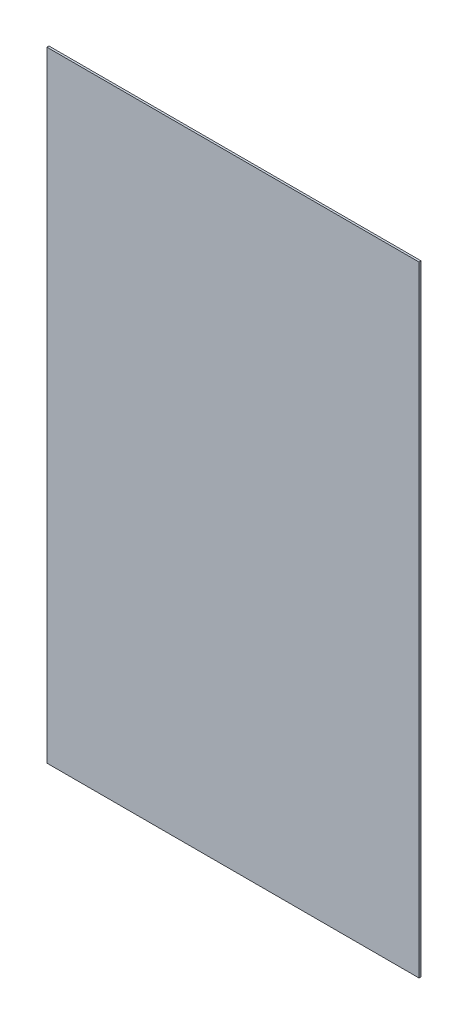
ISO-10303-21;
HEADER;
FILE_DESCRIPTION(('STEP AP214'),'2;1');
FILE_NAME('part.step','',(''),(''),'','','');
FILE_SCHEMA(('AUTOMOTIVE_DESIGN { 1 0 10303 214 1 1 1 1 }'));
ENDSEC;
DATA;
#1=APPLICATION_CONTEXT('core data for automotive mechanical design processes');
#2=APPLICATION_PROTOCOL_DEFINITION('international standard','automotive_design',2000,#1);
#3=PRODUCT_CONTEXT('',#1,'mechanical');
#4=PRODUCT('Part','Part','',(#3));
#5=PRODUCT_RELATED_PRODUCT_CATEGORY('part','',(#4));
#6=PRODUCT_DEFINITION_FORMATION('','',#4);
#7=PRODUCT_DEFINITION_CONTEXT('part definition',#1,'design');
#8=PRODUCT_DEFINITION('design','',#6,#7);
#9=PRODUCT_DEFINITION_SHAPE('','',#8);
#10=(LENGTH_UNIT() NAMED_UNIT(*) SI_UNIT(.MILLI.,.METRE.));
#11=(NAMED_UNIT(*) PLANE_ANGLE_UNIT() SI_UNIT($,.RADIAN.));
#12=(NAMED_UNIT(*) SI_UNIT($,.STERADIAN.) SOLID_ANGLE_UNIT());
#13=UNCERTAINTY_MEASURE_WITH_UNIT(LENGTH_MEASURE(1.E-05),#10,'distance_accuracy_value','');
#14=(GEOMETRIC_REPRESENTATION_CONTEXT(3) GLOBAL_UNCERTAINTY_ASSIGNED_CONTEXT((#13)) GLOBAL_UNIT_ASSIGNED_CONTEXT((#10,
#11,#12)) REPRESENTATION_CONTEXT('',''));
#15=CARTESIAN_POINT('',(0.,0.,0.));
#16=DIRECTION('',(0.,0.,1.));
#17=DIRECTION('',(1.,0.,0.));
#18=AXIS2_PLACEMENT_3D('',#15,#16,#17);
#19=CARTESIAN_POINT('',(-9.,-15.,0.1));
#20=DIRECTION('',(0.,1.,0.));
#21=DIRECTION('',(0.,0.,1.));
#22=AXIS2_PLACEMENT_3D('',#19,#20,#21);
#23=PLANE('',#22);
#24=DIRECTION('',(1.,0.,0.));
#25=VECTOR('',#24,1.);
#26=CARTESIAN_POINT('',(-9.,-15.,0.));
#27=LINE('',#26,#25);
#28=CARTESIAN_POINT('',(-9.,-15.,0.));
#29=VERTEX_POINT('',#28);
#30=CARTESIAN_POINT('',(9.,-15.,0.));
#31=VERTEX_POINT('',#30);
#32=EDGE_CURVE('E99',#29,#31,#27,.T.);
#33=ORIENTED_EDGE('',*,*,#32,.T.);
#34=DIRECTION('',(0.,0.,-1.));
#35=VECTOR('',#34,1.);
#36=CARTESIAN_POINT('',(9.,-15.,0.1));
#37=LINE('',#36,#35);
#38=CARTESIAN_POINT('',(9.,-15.,0.1));
#39=VERTEX_POINT('',#38);
#40=EDGE_CURVE('E11',#39,#31,#37,.T.);
#41=ORIENTED_EDGE('',*,*,#40,.F.);
#42=DIRECTION('',(1.,0.,0.));
#43=VECTOR('',#42,1.);
#44=CARTESIAN_POINT('',(-9.,-15.,0.1));
#45=LINE('',#44,#43);
#46=CARTESIAN_POINT('',(-9.,-15.,0.1));
#47=VERTEX_POINT('',#46);
#48=EDGE_CURVE('E85',#47,#39,#45,.T.);
#49=ORIENTED_EDGE('',*,*,#48,.F.);
#50=DIRECTION('',(0.,0.,-1.));
#51=VECTOR('',#50,1.);
#52=CARTESIAN_POINT('',(-9.,-15.,0.1));
#53=LINE('',#52,#51);
#54=EDGE_CURVE('E52',#47,#29,#53,.T.);
#55=ORIENTED_EDGE('',*,*,#54,.T.);
#56=EDGE_LOOP('',(#33,#41,#49,#55));
#57=FACE_BOUND('',#56,.T.);
#58=ADVANCED_FACE('F36',(#57),#23,.F.);
#59=CARTESIAN_POINT('',(9.,-15.,0.1));
#60=DIRECTION('',(-1.,0.,0.));
#61=DIRECTION('',(0.,0.,1.));
#62=AXIS2_PLACEMENT_3D('',#59,#60,#61);
#63=PLANE('',#62);
#64=DIRECTION('',(0.,1.,0.));
#65=VECTOR('',#64,1.);
#66=CARTESIAN_POINT('',(9.,-15.,0.));
#67=LINE('',#66,#65);
#68=CARTESIAN_POINT('',(9.,15.,0.));
#69=VERTEX_POINT('',#68);
#70=EDGE_CURVE('E90',#31,#69,#67,.T.);
#71=ORIENTED_EDGE('',*,*,#70,.T.);
#72=DIRECTION('',(0.,0.,-1.));
#73=VECTOR('',#72,1.);
#74=CARTESIAN_POINT('',(9.,15.,0.1));
#75=LINE('',#74,#73);
#76=CARTESIAN_POINT('',(9.,15.,0.1));
#77=VERTEX_POINT('',#76);
#78=EDGE_CURVE('E44',#77,#69,#75,.T.);
#79=ORIENTED_EDGE('',*,*,#78,.F.);
#80=DIRECTION('',(0.,1.,0.));
#81=VECTOR('',#80,1.);
#82=CARTESIAN_POINT('',(9.,-15.,0.1));
#83=LINE('',#82,#81);
#84=EDGE_CURVE('E77',#39,#77,#83,.T.);
#85=ORIENTED_EDGE('',*,*,#84,.F.);
#86=ORIENTED_EDGE('',*,*,#40,.T.);
#87=EDGE_LOOP('',(#71,#79,#85,#86));
#88=FACE_BOUND('',#87,.T.);
#89=ADVANCED_FACE('F89',(#88),#63,.F.);
#90=CARTESIAN_POINT('',(-9.,15.,0.1));
#91=DIRECTION('',(0.,1.,0.));
#92=DIRECTION('',(0.,0.,1.));
#93=AXIS2_PLACEMENT_3D('',#90,#91,#92);
#94=PLANE('',#93);
#95=DIRECTION('',(1.,0.,0.));
#96=VECTOR('',#95,1.);
#97=CARTESIAN_POINT('',(-9.,15.,0.));
#98=LINE('',#97,#96);
#99=CARTESIAN_POINT('',(-9.,15.,0.));
#100=VERTEX_POINT('',#99);
#101=EDGE_CURVE('E102',#100,#69,#98,.T.);
#102=ORIENTED_EDGE('',*,*,#101,.F.);
#103=DIRECTION('',(0.,0.,-1.));
#104=VECTOR('',#103,1.);
#105=CARTESIAN_POINT('',(-9.,15.,0.1));
#106=LINE('',#105,#104);
#107=CARTESIAN_POINT('',(-9.,15.,0.1));
#108=VERTEX_POINT('',#107);
#109=EDGE_CURVE('E66',#108,#100,#106,.T.);
#110=ORIENTED_EDGE('',*,*,#109,.F.);
#111=DIRECTION('',(1.,0.,0.));
#112=VECTOR('',#111,1.);
#113=CARTESIAN_POINT('',(-9.,15.,0.1));
#114=LINE('',#113,#112);
#115=EDGE_CURVE('E84',#108,#77,#114,.T.);
#116=ORIENTED_EDGE('',*,*,#115,.T.);
#117=ORIENTED_EDGE('',*,*,#78,.T.);
#118=EDGE_LOOP('',(#102,#110,#116,#117));
#119=FACE_BOUND('',#118,.T.);
#120=ADVANCED_FACE('F93',(#119),#94,.T.);
#121=CARTESIAN_POINT('',(-9.,-15.,0.1));
#122=DIRECTION('',(-1.,0.,0.));
#123=DIRECTION('',(0.,0.,1.));
#124=AXIS2_PLACEMENT_3D('',#121,#122,#123);
#125=PLANE('',#124);
#126=DIRECTION('',(0.,1.,0.));
#127=VECTOR('',#126,1.);
#128=CARTESIAN_POINT('',(-9.,-15.,0.));
#129=LINE('',#128,#127);
#130=EDGE_CURVE('E104',#29,#100,#129,.T.);
#131=ORIENTED_EDGE('',*,*,#130,.F.);
#132=ORIENTED_EDGE('',*,*,#54,.F.);
#133=DIRECTION('',(0.,1.,0.));
#134=VECTOR('',#133,1.);
#135=CARTESIAN_POINT('',(-9.,-15.,0.1));
#136=LINE('',#135,#134);
#137=EDGE_CURVE('E94',#47,#108,#136,.T.);
#138=ORIENTED_EDGE('',*,*,#137,.T.);
#139=ORIENTED_EDGE('',*,*,#109,.T.);
#140=EDGE_LOOP('',(#131,#132,#138,#139));
#141=FACE_BOUND('',#140,.T.);
#142=ADVANCED_FACE('F110',(#141),#125,.T.);
#143=CARTESIAN_POINT('',(0.,0.,0.1));
#144=DIRECTION('',(0.,0.,1.));
#145=DIRECTION('',(1.,0.,0.));
#146=AXIS2_PLACEMENT_3D('',#143,#144,#145);
#147=PLANE('',#146);
#148=ORIENTED_EDGE('',*,*,#48,.T.);
#149=ORIENTED_EDGE('',*,*,#84,.T.);
#150=ORIENTED_EDGE('',*,*,#115,.F.);
#151=ORIENTED_EDGE('',*,*,#137,.F.);
#152=EDGE_LOOP('',(#148,#149,#150,#151));
#153=FACE_BOUND('',#152,.T.);
#154=ADVANCED_FACE('F81',(#153),#147,.T.);
#155=CARTESIAN_POINT('',(0.,0.,0.));
#156=DIRECTION('',(0.,0.,1.));
#157=DIRECTION('',(1.,0.,0.));
#158=AXIS2_PLACEMENT_3D('',#155,#156,#157);
#159=PLANE('',#158);
#160=ORIENTED_EDGE('',*,*,#32,.F.);
#161=ORIENTED_EDGE('',*,*,#130,.T.);
#162=ORIENTED_EDGE('',*,*,#101,.T.);
#163=ORIENTED_EDGE('',*,*,#70,.F.);
#164=EDGE_LOOP('',(#160,#161,#162,#163));
#165=FACE_BOUND('',#164,.T.);
#166=ADVANCED_FACE('F109',(#165),#159,.F.);
#167=CLOSED_SHELL('',(#58,#89,#120,#142,#154,#166));
#168=MANIFOLD_SOLID_BREP('B2',#167);
#169=ADVANCED_BREP_SHAPE_REPRESENTATION('',(#18,#168),#14);
#170=SHAPE_DEFINITION_REPRESENTATION(#9,#169);
ENDSEC;
END-ISO-10303-21;
